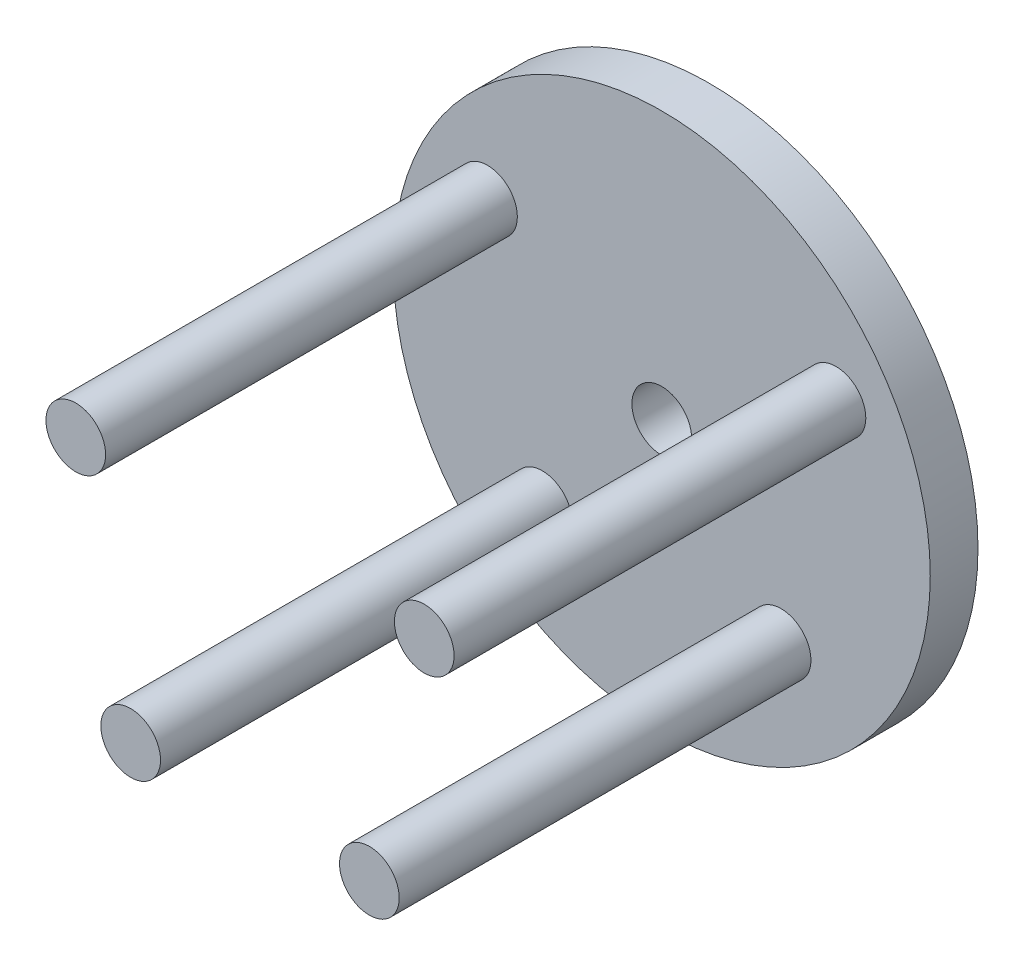
ISO-10303-21;
HEADER;
FILE_DESCRIPTION(('STEP AP214'),'2;1');
FILE_NAME('part.step','',(''),(''),'','','');
FILE_SCHEMA(('AUTOMOTIVE_DESIGN { 1 0 10303 214 1 1 1 1 }'));
ENDSEC;
DATA;
#1=APPLICATION_CONTEXT('core data for automotive mechanical design processes');
#2=APPLICATION_PROTOCOL_DEFINITION('international standard','automotive_design',2000,#1);
#3=PRODUCT_CONTEXT('',#1,'mechanical');
#4=PRODUCT('Part','Part','',(#3));
#5=PRODUCT_RELATED_PRODUCT_CATEGORY('part','',(#4));
#6=PRODUCT_DEFINITION_FORMATION('','',#4);
#7=PRODUCT_DEFINITION_CONTEXT('part definition',#1,'design');
#8=PRODUCT_DEFINITION('design','',#6,#7);
#9=PRODUCT_DEFINITION_SHAPE('','',#8);
#10=(LENGTH_UNIT() NAMED_UNIT(*) SI_UNIT(.MILLI.,.METRE.));
#11=(NAMED_UNIT(*) PLANE_ANGLE_UNIT() SI_UNIT($,.RADIAN.));
#12=(NAMED_UNIT(*) SI_UNIT($,.STERADIAN.) SOLID_ANGLE_UNIT());
#13=UNCERTAINTY_MEASURE_WITH_UNIT(LENGTH_MEASURE(1.E-05),#10,'distance_accuracy_value','');
#14=(GEOMETRIC_REPRESENTATION_CONTEXT(3) GLOBAL_UNCERTAINTY_ASSIGNED_CONTEXT((#13)) GLOBAL_UNIT_ASSIGNED_CONTEXT((#10,
#11,#12)) REPRESENTATION_CONTEXT('',''));
#15=CARTESIAN_POINT('',(0.,0.,0.));
#16=DIRECTION('',(0.,0.,1.));
#17=DIRECTION('',(1.,0.,0.));
#18=AXIS2_PLACEMENT_3D('',#15,#16,#17);
#19=CARTESIAN_POINT('',(0.,0.,5.08));
#20=DIRECTION('',(0.,0.,-1.));
#21=DIRECTION('',(-1.,0.,0.));
#22=AXIS2_PLACEMENT_3D('',#19,#20,#21);
#23=CYLINDRICAL_SURFACE('',#22,28.575);
#24=CARTESIAN_POINT('',(0.,0.,5.08));
#25=DIRECTION('',(0.,0.,1.));
#26=DIRECTION('',(1.,0.,0.));
#27=AXIS2_PLACEMENT_3D('',#24,#25,#26);
#28=CIRCLE('',#27,28.575);
#29=CARTESIAN_POINT('',(28.575,0.,5.08));
#30=VERTEX_POINT('',#29);
#31=EDGE_CURVE('E10',#30,#30,#28,.T.);
#32=ORIENTED_EDGE('',*,*,#31,.F.);
#33=EDGE_LOOP('',(#32));
#34=FACE_BOUND('',#33,.T.);
#35=CARTESIAN_POINT('',(0.,0.,0.));
#36=DIRECTION('',(0.,0.,1.));
#37=DIRECTION('',(1.,0.,0.));
#38=AXIS2_PLACEMENT_3D('',#35,#36,#37);
#39=CIRCLE('',#38,28.575);
#40=CARTESIAN_POINT('',(28.575,0.,0.));
#41=VERTEX_POINT('',#40);
#42=EDGE_CURVE('E34',#41,#41,#39,.T.);
#43=ORIENTED_EDGE('',*,*,#42,.T.);
#44=EDGE_LOOP('',(#43));
#45=FACE_BOUND('',#44,.T.);
#46=ADVANCED_FACE('F31',(#34,#45),#23,.T.);
#47=CARTESIAN_POINT('',(0.,0.,5.08));
#48=DIRECTION('',(0.,0.,1.));
#49=DIRECTION('',(1.,0.,0.));
#50=AXIS2_PLACEMENT_3D('',#47,#48,#49);
#51=PLANE('',#50);
#52=CARTESIAN_POINT('',(0.,0.,5.08));
#53=DIRECTION('',(0.,0.,1.));
#54=DIRECTION('',(1.,0.,0.));
#55=AXIS2_PLACEMENT_3D('',#52,#53,#54);
#56=CIRCLE('',#55,3.175);
#57=CARTESIAN_POINT('',(3.175,0.,5.08));
#58=VERTEX_POINT('',#57);
#59=EDGE_CURVE('E64',#58,#58,#56,.T.);
#60=ORIENTED_EDGE('',*,*,#59,.F.);
#61=EDGE_LOOP('',(#60));
#62=FACE_BOUND('',#61,.T.);
#63=CARTESIAN_POINT('',(12.7,-14.1255695294189,5.08));
#64=DIRECTION('',(0.,0.,1.));
#65=DIRECTION('',(1.,0.,0.));
#66=AXIS2_PLACEMENT_3D('',#63,#64,#65);
#67=CIRCLE('',#66,3.175);
#68=CARTESIAN_POINT('',(15.875,-14.1255695294189,5.08));
#69=VERTEX_POINT('',#68);
#70=EDGE_CURVE('E61',#69,#69,#67,.T.);
#71=ORIENTED_EDGE('',*,*,#70,.F.);
#72=EDGE_LOOP('',(#71));
#73=FACE_BOUND('',#72,.T.);
#74=CARTESIAN_POINT('',(-12.7,-14.1255695294189,5.08));
#75=DIRECTION('',(0.,0.,1.));
#76=DIRECTION('',(1.,0.,0.));
#77=AXIS2_PLACEMENT_3D('',#74,#75,#76);
#78=CIRCLE('',#77,3.175);
#79=CARTESIAN_POINT('',(-9.525,-14.1255695294189,5.08));
#80=VERTEX_POINT('',#79);
#81=EDGE_CURVE('E55',#80,#80,#78,.T.);
#82=ORIENTED_EDGE('',*,*,#81,.F.);
#83=EDGE_LOOP('',(#82));
#84=FACE_BOUND('',#83,.T.);
#85=CARTESIAN_POINT('',(18.542,11.1125,5.08));
#86=DIRECTION('',(0.,0.,1.));
#87=DIRECTION('',(1.,0.,0.));
#88=AXIS2_PLACEMENT_3D('',#85,#86,#87);
#89=CIRCLE('',#88,3.175);
#90=CARTESIAN_POINT('',(21.717,11.1125,5.08));
#91=VERTEX_POINT('',#90);
#92=EDGE_CURVE('E49',#91,#91,#89,.T.);
#93=ORIENTED_EDGE('',*,*,#92,.F.);
#94=EDGE_LOOP('',(#93));
#95=FACE_BOUND('',#94,.T.);
#96=CARTESIAN_POINT('',(-18.542,11.1125,5.08));
#97=DIRECTION('',(0.,0.,1.));
#98=DIRECTION('',(1.,0.,0.));
#99=AXIS2_PLACEMENT_3D('',#96,#97,#98);
#100=CIRCLE('',#99,3.175);
#101=CARTESIAN_POINT('',(-15.367,11.1125,5.08));
#102=VERTEX_POINT('',#101);
#103=EDGE_CURVE('E43',#102,#102,#100,.T.);
#104=ORIENTED_EDGE('',*,*,#103,.F.);
#105=EDGE_LOOP('',(#104));
#106=FACE_BOUND('',#105,.T.);
#107=ORIENTED_EDGE('',*,*,#31,.T.);
#108=EDGE_LOOP('',(#107));
#109=FACE_BOUND('',#108,.T.);
#110=ADVANCED_FACE('F79',(#62,#73,#84,#95,#106,#109),#51,.T.);
#111=CARTESIAN_POINT('',(0.,0.,0.));
#112=DIRECTION('',(0.,0.,1.));
#113=DIRECTION('',(1.,0.,0.));
#114=AXIS2_PLACEMENT_3D('',#111,#112,#113);
#115=PLANE('',#114);
#116=CARTESIAN_POINT('',(0.,0.,0.));
#117=DIRECTION('',(0.,0.,-1.));
#118=DIRECTION('',(-1.,0.,0.));
#119=AXIS2_PLACEMENT_3D('',#116,#117,#118);
#120=CIRCLE('',#119,3.175);
#121=CARTESIAN_POINT('',(-3.175,0.,0.));
#122=VERTEX_POINT('',#121);
#123=EDGE_CURVE('E69',#122,#122,#120,.T.);
#124=ORIENTED_EDGE('',*,*,#123,.F.);
#125=EDGE_LOOP('',(#124));
#126=FACE_BOUND('',#125,.T.);
#127=ORIENTED_EDGE('',*,*,#42,.F.);
#128=EDGE_LOOP('',(#127));
#129=FACE_BOUND('',#128,.T.);
#130=ADVANCED_FACE('F75',(#126,#129),#115,.F.);
#131=CARTESIAN_POINT('',(-18.542,11.1125,48.895));
#132=DIRECTION('',(0.,0.,-1.));
#133=DIRECTION('',(-1.,0.,0.));
#134=AXIS2_PLACEMENT_3D('',#131,#132,#133);
#135=CYLINDRICAL_SURFACE('',#134,3.175);
#136=CARTESIAN_POINT('',(-18.542,11.1125,48.895));
#137=DIRECTION('',(0.,0.,1.));
#138=DIRECTION('',(1.,0.,0.));
#139=AXIS2_PLACEMENT_3D('',#136,#137,#138);
#140=CIRCLE('',#139,3.175);
#141=CARTESIAN_POINT('',(-15.367,11.1125,48.895));
#142=VERTEX_POINT('',#141);
#143=EDGE_CURVE('E41',#142,#142,#140,.T.);
#144=ORIENTED_EDGE('',*,*,#143,.F.);
#145=EDGE_LOOP('',(#144));
#146=FACE_BOUND('',#145,.T.);
#147=ORIENTED_EDGE('',*,*,#103,.T.);
#148=EDGE_LOOP('',(#147));
#149=FACE_BOUND('',#148,.T.);
#150=ADVANCED_FACE('F78',(#146,#149),#135,.T.);
#151=CARTESIAN_POINT('',(-18.542,11.1125,48.895));
#152=DIRECTION('',(0.,0.,1.));
#153=DIRECTION('',(1.,0.,0.));
#154=AXIS2_PLACEMENT_3D('',#151,#152,#153);
#155=PLANE('',#154);
#156=ORIENTED_EDGE('',*,*,#143,.T.);
#157=EDGE_LOOP('',(#156));
#158=FACE_BOUND('',#157,.T.);
#159=ADVANCED_FACE('F96',(#158),#155,.T.);
#160=CARTESIAN_POINT('',(18.542,11.1125,48.895));
#161=DIRECTION('',(0.,0.,-1.));
#162=DIRECTION('',(-1.,0.,0.));
#163=AXIS2_PLACEMENT_3D('',#160,#161,#162);
#164=CYLINDRICAL_SURFACE('',#163,3.175);
#165=CARTESIAN_POINT('',(18.542,11.1125,48.895));
#166=DIRECTION('',(0.,0.,1.));
#167=DIRECTION('',(1.,0.,0.));
#168=AXIS2_PLACEMENT_3D('',#165,#166,#167);
#169=CIRCLE('',#168,3.175);
#170=CARTESIAN_POINT('',(21.717,11.1125,48.895));
#171=VERTEX_POINT('',#170);
#172=EDGE_CURVE('E46',#171,#171,#169,.T.);
#173=ORIENTED_EDGE('',*,*,#172,.F.);
#174=EDGE_LOOP('',(#173));
#175=FACE_BOUND('',#174,.T.);
#176=ORIENTED_EDGE('',*,*,#92,.T.);
#177=EDGE_LOOP('',(#176));
#178=FACE_BOUND('',#177,.T.);
#179=ADVANCED_FACE('F100',(#175,#178),#164,.T.);
#180=CARTESIAN_POINT('',(18.542,11.1125,48.895));
#181=DIRECTION('',(0.,0.,1.));
#182=DIRECTION('',(1.,0.,0.));
#183=AXIS2_PLACEMENT_3D('',#180,#181,#182);
#184=PLANE('',#183);
#185=ORIENTED_EDGE('',*,*,#172,.T.);
#186=EDGE_LOOP('',(#185));
#187=FACE_BOUND('',#186,.T.);
#188=ADVANCED_FACE('F104',(#187),#184,.T.);
#189=CARTESIAN_POINT('',(-12.7,-14.1255695294189,48.895));
#190=DIRECTION('',(0.,0.,-1.));
#191=DIRECTION('',(-1.,0.,0.));
#192=AXIS2_PLACEMENT_3D('',#189,#190,#191);
#193=CYLINDRICAL_SURFACE('',#192,3.175);
#194=CARTESIAN_POINT('',(-12.7,-14.1255695294189,48.895));
#195=DIRECTION('',(0.,0.,1.));
#196=DIRECTION('',(1.,0.,0.));
#197=AXIS2_PLACEMENT_3D('',#194,#195,#196);
#198=CIRCLE('',#197,3.175);
#199=CARTESIAN_POINT('',(-9.525,-14.1255695294189,48.895));
#200=VERTEX_POINT('',#199);
#201=EDGE_CURVE('E52',#200,#200,#198,.T.);
#202=ORIENTED_EDGE('',*,*,#201,.F.);
#203=EDGE_LOOP('',(#202));
#204=FACE_BOUND('',#203,.T.);
#205=ORIENTED_EDGE('',*,*,#81,.T.);
#206=EDGE_LOOP('',(#205));
#207=FACE_BOUND('',#206,.T.);
#208=ADVANCED_FACE('F108',(#204,#207),#193,.T.);
#209=CARTESIAN_POINT('',(-12.7,-14.1255695294189,48.895));
#210=DIRECTION('',(0.,0.,1.));
#211=DIRECTION('',(1.,0.,0.));
#212=AXIS2_PLACEMENT_3D('',#209,#210,#211);
#213=PLANE('',#212);
#214=ORIENTED_EDGE('',*,*,#201,.T.);
#215=EDGE_LOOP('',(#214));
#216=FACE_BOUND('',#215,.T.);
#217=ADVANCED_FACE('F112',(#216),#213,.T.);
#218=CARTESIAN_POINT('',(12.7,-14.1255695294189,48.895));
#219=DIRECTION('',(0.,0.,-1.));
#220=DIRECTION('',(-1.,0.,0.));
#221=AXIS2_PLACEMENT_3D('',#218,#219,#220);
#222=CYLINDRICAL_SURFACE('',#221,3.175);
#223=CARTESIAN_POINT('',(12.7,-14.1255695294189,48.895));
#224=DIRECTION('',(0.,0.,1.));
#225=DIRECTION('',(1.,0.,0.));
#226=AXIS2_PLACEMENT_3D('',#223,#224,#225);
#227=CIRCLE('',#226,3.175);
#228=CARTESIAN_POINT('',(15.875,-14.1255695294189,48.895));
#229=VERTEX_POINT('',#228);
#230=EDGE_CURVE('E58',#229,#229,#227,.T.);
#231=ORIENTED_EDGE('',*,*,#230,.F.);
#232=EDGE_LOOP('',(#231));
#233=FACE_BOUND('',#232,.T.);
#234=ORIENTED_EDGE('',*,*,#70,.T.);
#235=EDGE_LOOP('',(#234));
#236=FACE_BOUND('',#235,.T.);
#237=ADVANCED_FACE('F116',(#233,#236),#222,.T.);
#238=CARTESIAN_POINT('',(12.7,-14.1255695294189,48.895));
#239=DIRECTION('',(0.,0.,1.));
#240=DIRECTION('',(1.,0.,0.));
#241=AXIS2_PLACEMENT_3D('',#238,#239,#240);
#242=PLANE('',#241);
#243=ORIENTED_EDGE('',*,*,#230,.T.);
#244=EDGE_LOOP('',(#243));
#245=FACE_BOUND('',#244,.T.);
#246=ADVANCED_FACE('F120',(#245),#242,.T.);
#247=CARTESIAN_POINT('',(0.,0.,48.895));
#248=DIRECTION('',(0.,0.,-1.));
#249=DIRECTION('',(-1.,0.,0.));
#250=AXIS2_PLACEMENT_3D('',#247,#248,#249);
#251=CYLINDRICAL_SURFACE('',#250,3.175);
#252=ORIENTED_EDGE('',*,*,#59,.T.);
#253=EDGE_LOOP('',(#252));
#254=FACE_BOUND('',#253,.T.);
#255=ORIENTED_EDGE('',*,*,#123,.T.);
#256=EDGE_LOOP('',(#255));
#257=FACE_BOUND('',#256,.T.);
#258=ADVANCED_FACE('F73',(#254,#257),#251,.F.);
#259=CLOSED_SHELL('',(#46,#110,#130,#150,#159,#179,#188,#208,#217,#237,#246,#258));
#260=MANIFOLD_SOLID_BREP('B2',#259);
#261=ADVANCED_BREP_SHAPE_REPRESENTATION('',(#18,#260),#14);
#262=SHAPE_DEFINITION_REPRESENTATION(#9,#261);
ENDSEC;
END-ISO-10303-21;
